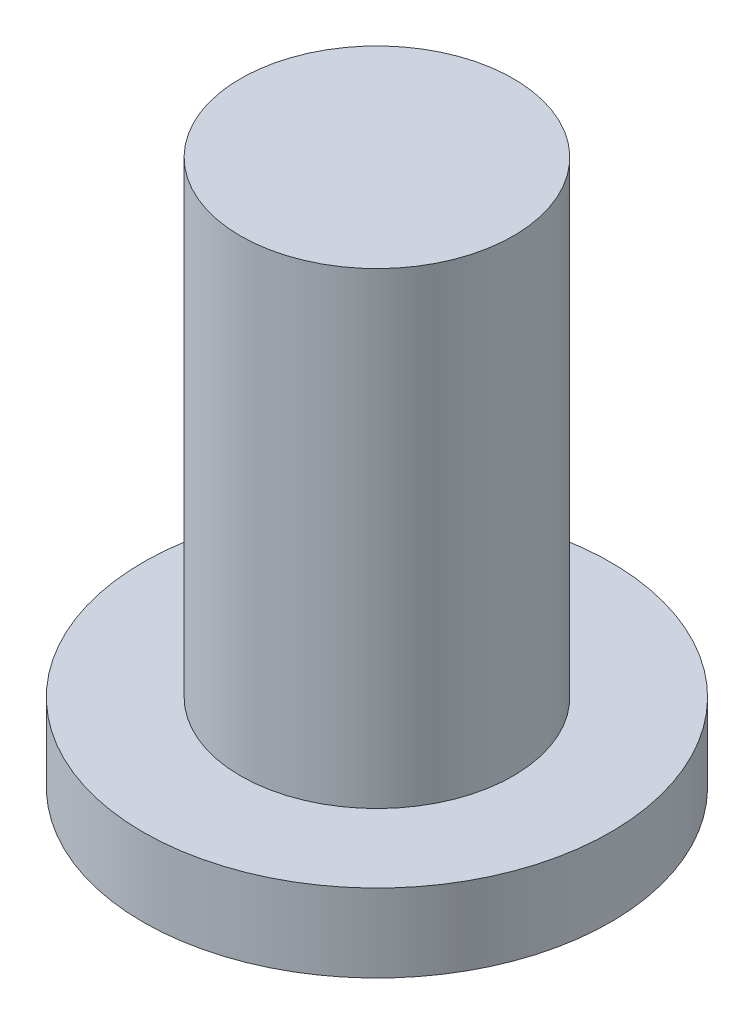
ISO-10303-21;
HEADER;
FILE_DESCRIPTION(('STEP AP214'),'2;1');
FILE_NAME('part.step','',(''),(''),'','','');
FILE_SCHEMA(('AUTOMOTIVE_DESIGN { 1 0 10303 214 1 1 1 1 }'));
ENDSEC;
DATA;
#1=APPLICATION_CONTEXT('core data for automotive mechanical design processes');
#2=APPLICATION_PROTOCOL_DEFINITION('international standard','automotive_design',2000,#1);
#3=PRODUCT_CONTEXT('',#1,'mechanical');
#4=PRODUCT('Part','Part','',(#3));
#5=PRODUCT_RELATED_PRODUCT_CATEGORY('part','',(#4));
#6=PRODUCT_DEFINITION_FORMATION('','',#4);
#7=PRODUCT_DEFINITION_CONTEXT('part definition',#1,'design');
#8=PRODUCT_DEFINITION('design','',#6,#7);
#9=PRODUCT_DEFINITION_SHAPE('','',#8);
#10=(LENGTH_UNIT() NAMED_UNIT(*) SI_UNIT(.MILLI.,.METRE.));
#11=(NAMED_UNIT(*) PLANE_ANGLE_UNIT() SI_UNIT($,.RADIAN.));
#12=(NAMED_UNIT(*) SI_UNIT($,.STERADIAN.) SOLID_ANGLE_UNIT());
#13=UNCERTAINTY_MEASURE_WITH_UNIT(LENGTH_MEASURE(1.E-05),#10,'distance_accuracy_value','');
#14=(GEOMETRIC_REPRESENTATION_CONTEXT(3) GLOBAL_UNCERTAINTY_ASSIGNED_CONTEXT((#13)) GLOBAL_UNIT_ASSIGNED_CONTEXT((#10,
#11,#12)) REPRESENTATION_CONTEXT('',''));
#15=CARTESIAN_POINT('',(0.,0.,0.));
#16=DIRECTION('',(0.,0.,1.));
#17=DIRECTION('',(1.,0.,0.));
#18=AXIS2_PLACEMENT_3D('',#15,#16,#17);
#19=CARTESIAN_POINT('',(0.,2.,0.));
#20=DIRECTION('',(0.,-1.,0.));
#21=DIRECTION('',(0.,0.,-1.));
#22=AXIS2_PLACEMENT_3D('',#19,#20,#21);
#23=CYLINDRICAL_SURFACE('',#22,6.);
#24=CARTESIAN_POINT('',(0.,2.,0.));
#25=DIRECTION('',(0.,1.,0.));
#26=DIRECTION('',(0.,0.,1.));
#27=AXIS2_PLACEMENT_3D('',#24,#25,#26);
#28=CIRCLE('',#27,6.);
#29=CARTESIAN_POINT('',(0.,2.,6.));
#30=VERTEX_POINT('',#29);
#31=EDGE_CURVE('E38',#30,#30,#28,.T.);
#32=ORIENTED_EDGE('',*,*,#31,.F.);
#33=EDGE_LOOP('',(#32));
#34=FACE_BOUND('',#33,.T.);
#35=CARTESIAN_POINT('',(0.,0.,0.));
#36=DIRECTION('',(0.,1.,0.));
#37=DIRECTION('',(0.,0.,1.));
#38=AXIS2_PLACEMENT_3D('',#35,#36,#37);
#39=CIRCLE('',#38,6.);
#40=CARTESIAN_POINT('',(0.,0.,6.));
#41=VERTEX_POINT('',#40);
#42=EDGE_CURVE('E34',#41,#41,#39,.T.);
#43=ORIENTED_EDGE('',*,*,#42,.T.);
#44=EDGE_LOOP('',(#43));
#45=FACE_BOUND('',#44,.T.);
#46=ADVANCED_FACE('F31',(#34,#45),#23,.T.);
#47=CARTESIAN_POINT('',(0.,2.,0.));
#48=DIRECTION('',(0.,1.,0.));
#49=DIRECTION('',(0.,0.,1.));
#50=AXIS2_PLACEMENT_3D('',#47,#48,#49);
#51=PLANE('',#50);
#52=CARTESIAN_POINT('',(0.,2.,0.));
#53=DIRECTION('',(0.,1.,0.));
#54=DIRECTION('',(0.,0.,1.));
#55=AXIS2_PLACEMENT_3D('',#52,#53,#54);
#56=CIRCLE('',#55,3.5);
#57=CARTESIAN_POINT('',(0.,2.,3.5));
#58=VERTEX_POINT('',#57);
#59=EDGE_CURVE('E10',#58,#58,#56,.T.);
#60=ORIENTED_EDGE('',*,*,#59,.F.);
#61=EDGE_LOOP('',(#60));
#62=FACE_BOUND('',#61,.T.);
#63=ORIENTED_EDGE('',*,*,#31,.T.);
#64=EDGE_LOOP('',(#63));
#65=FACE_BOUND('',#64,.T.);
#66=ADVANCED_FACE('F55',(#62,#65),#51,.T.);
#67=CARTESIAN_POINT('',(0.,0.,0.));
#68=DIRECTION('',(0.,1.,0.));
#69=DIRECTION('',(0.,0.,1.));
#70=AXIS2_PLACEMENT_3D('',#67,#68,#69);
#71=PLANE('',#70);
#72=ORIENTED_EDGE('',*,*,#42,.F.);
#73=EDGE_LOOP('',(#72));
#74=FACE_BOUND('',#73,.T.);
#75=ADVANCED_FACE('F52',(#74),#71,.F.);
#76=CARTESIAN_POINT('',(0.,14.,0.));
#77=DIRECTION('',(0.,-1.,0.));
#78=DIRECTION('',(0.,0.,-1.));
#79=AXIS2_PLACEMENT_3D('',#76,#77,#78);
#80=CYLINDRICAL_SURFACE('',#79,3.5);
#81=CARTESIAN_POINT('',(0.,14.,0.));
#82=DIRECTION('',(0.,1.,0.));
#83=DIRECTION('',(0.,0.,1.));
#84=AXIS2_PLACEMENT_3D('',#81,#82,#83);
#85=CIRCLE('',#84,3.5);
#86=CARTESIAN_POINT('',(0.,14.,3.5));
#87=VERTEX_POINT('',#86);
#88=EDGE_CURVE('E44',#87,#87,#85,.T.);
#89=ORIENTED_EDGE('',*,*,#88,.F.);
#90=EDGE_LOOP('',(#89));
#91=FACE_BOUND('',#90,.T.);
#92=ORIENTED_EDGE('',*,*,#59,.T.);
#93=EDGE_LOOP('',(#92));
#94=FACE_BOUND('',#93,.T.);
#95=ADVANCED_FACE('F54',(#91,#94),#80,.T.);
#96=CARTESIAN_POINT('',(0.,14.,0.));
#97=DIRECTION('',(0.,1.,0.));
#98=DIRECTION('',(0.,0.,1.));
#99=AXIS2_PLACEMENT_3D('',#96,#97,#98);
#100=PLANE('',#99);
#101=ORIENTED_EDGE('',*,*,#88,.T.);
#102=EDGE_LOOP('',(#101));
#103=FACE_BOUND('',#102,.T.);
#104=ADVANCED_FACE('F60',(#103),#100,.T.);
#105=CLOSED_SHELL('',(#46,#66,#75,#95,#104));
#106=MANIFOLD_SOLID_BREP('B2',#105);
#107=ADVANCED_BREP_SHAPE_REPRESENTATION('',(#18,#106),#14);
#108=SHAPE_DEFINITION_REPRESENTATION(#9,#107);
ENDSEC;
END-ISO-10303-21;
